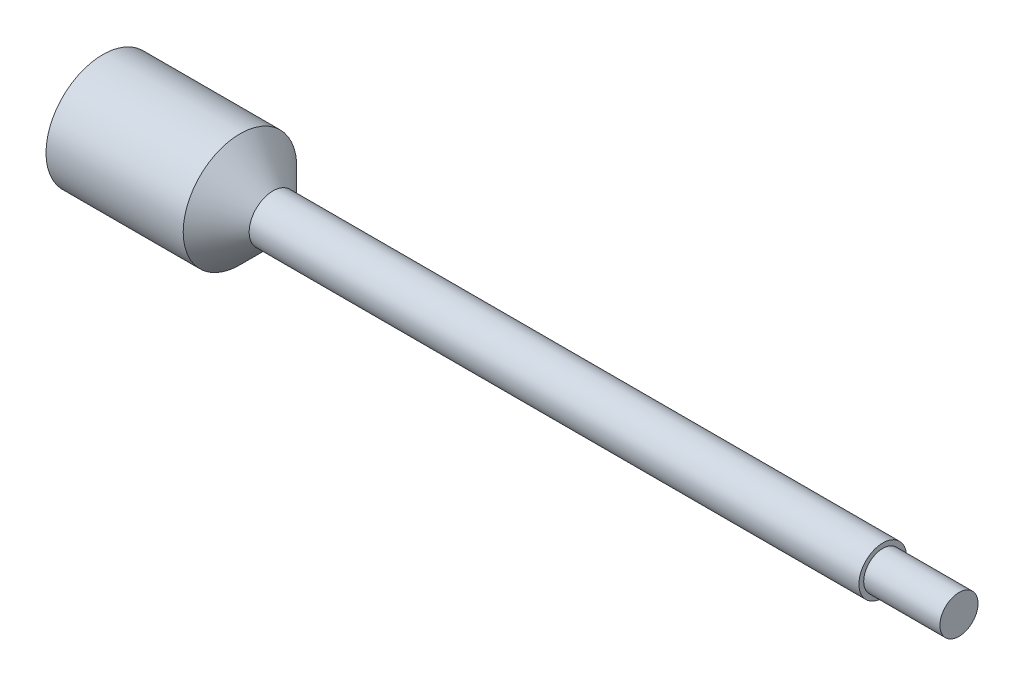
ISO-10303-21;
HEADER;
FILE_DESCRIPTION(('STEP AP214'),'2;1');
FILE_NAME('part.step','',(''),(''),'','','');
FILE_SCHEMA(('AUTOMOTIVE_DESIGN { 1 0 10303 214 1 1 1 1 }'));
ENDSEC;
DATA;
#1=APPLICATION_CONTEXT('core data for automotive mechanical design processes');
#2=APPLICATION_PROTOCOL_DEFINITION('international standard','automotive_design',2000,#1);
#3=PRODUCT_CONTEXT('',#1,'mechanical');
#4=PRODUCT('Part','Part','',(#3));
#5=PRODUCT_RELATED_PRODUCT_CATEGORY('part','',(#4));
#6=PRODUCT_DEFINITION_FORMATION('','',#4);
#7=PRODUCT_DEFINITION_CONTEXT('part definition',#1,'design');
#8=PRODUCT_DEFINITION('design','',#6,#7);
#9=PRODUCT_DEFINITION_SHAPE('','',#8);
#10=(LENGTH_UNIT() NAMED_UNIT(*) SI_UNIT(.MILLI.,.METRE.));
#11=(NAMED_UNIT(*) PLANE_ANGLE_UNIT() SI_UNIT($,.RADIAN.));
#12=(NAMED_UNIT(*) SI_UNIT($,.STERADIAN.) SOLID_ANGLE_UNIT());
#13=UNCERTAINTY_MEASURE_WITH_UNIT(LENGTH_MEASURE(1.E-05),#10,'distance_accuracy_value','');
#14=(GEOMETRIC_REPRESENTATION_CONTEXT(3) GLOBAL_UNCERTAINTY_ASSIGNED_CONTEXT((#13)) GLOBAL_UNIT_ASSIGNED_CONTEXT((#10,
#11,#12)) REPRESENTATION_CONTEXT('',''));
#15=CARTESIAN_POINT('',(0.,0.,0.));
#16=DIRECTION('',(0.,0.,1.));
#17=DIRECTION('',(1.,0.,0.));
#18=AXIS2_PLACEMENT_3D('',#15,#16,#17);
#19=CARTESIAN_POINT('',(-55.8411610675491,-112.071183448343,0.));
#20=DIRECTION('',(-1.,0.,0.));
#21=DIRECTION('',(0.,0.,1.));
#22=AXIS2_PLACEMENT_3D('',#19,#20,#21);
#23=PLANE('',#22);
#24=CARTESIAN_POINT('',(-55.8411610675491,0.,0.));
#25=DIRECTION('',(-1.,0.,0.));
#26=DIRECTION('',(0.,0.,1.));
#27=AXIS2_PLACEMENT_3D('',#24,#25,#26);
#28=CIRCLE('',#27,9.4615);
#29=CARTESIAN_POINT('',(-55.8411610675491,0.,9.4615));
#30=VERTEX_POINT('',#29);
#31=EDGE_CURVE('E54',#30,#30,#28,.T.);
#32=ORIENTED_EDGE('',*,*,#31,.T.);
#33=EDGE_LOOP('',(#32));
#34=FACE_BOUND('',#33,.T.);
#35=ADVANCED_FACE('F32',(#34),#23,.T.);
#36=CARTESIAN_POINT('',(86.8115889324509,-112.071183448343,0.));
#37=DIRECTION('',(1.,0.,0.));
#38=DIRECTION('',(0.,0.,-1.));
#39=AXIS2_PLACEMENT_3D('',#36,#37,#38);
#40=PLANE('',#39);
#41=CARTESIAN_POINT('',(86.8115889324509,0.,0.));
#42=DIRECTION('',(-1.,0.,0.));
#43=DIRECTION('',(0.,0.,1.));
#44=AXIS2_PLACEMENT_3D('',#41,#42,#43);
#45=CIRCLE('',#44,3.175);
#46=CARTESIAN_POINT('',(86.8115889324509,0.,3.175));
#47=VERTEX_POINT('',#46);
#48=EDGE_CURVE('E10',#47,#47,#45,.T.);
#49=ORIENTED_EDGE('',*,*,#48,.F.);
#50=EDGE_LOOP('',(#49));
#51=FACE_BOUND('',#50,.T.);
#52=ADVANCED_FACE('F71',(#51),#40,.T.);
#53=CARTESIAN_POINT('',(-55.8411610675491,0.,0.));
#54=DIRECTION('',(-1.,0.,0.));
#55=DIRECTION('',(0.,0.,1.));
#56=AXIS2_PLACEMENT_3D('',#53,#54,#55);
#57=CYLINDRICAL_SURFACE('',#56,3.175);
#58=ORIENTED_EDGE('',*,*,#48,.T.);
#59=EDGE_LOOP('',(#58));
#60=FACE_BOUND('',#59,.T.);
#61=CARTESIAN_POINT('',(74.1115889324509,0.,0.));
#62=DIRECTION('',(-1.,0.,0.));
#63=DIRECTION('',(0.,0.,1.));
#64=AXIS2_PLACEMENT_3D('',#61,#62,#63);
#65=CIRCLE('',#64,3.175);
#66=CARTESIAN_POINT('',(74.1115889324509,0.,3.175));
#67=VERTEX_POINT('',#66);
#68=EDGE_CURVE('E38',#67,#67,#65,.T.);
#69=ORIENTED_EDGE('',*,*,#68,.F.);
#70=EDGE_LOOP('',(#69));
#71=FACE_BOUND('',#70,.T.);
#72=ADVANCED_FACE('F75',(#60,#71),#57,.T.);
#73=CARTESIAN_POINT('',(74.1115889324509,-112.071183448343,0.));
#74=DIRECTION('',(1.,0.,0.));
#75=DIRECTION('',(0.,0.,-1.));
#76=AXIS2_PLACEMENT_3D('',#73,#74,#75);
#77=PLANE('',#76);
#78=ORIENTED_EDGE('',*,*,#68,.T.);
#79=EDGE_LOOP('',(#78));
#80=FACE_BOUND('',#79,.T.);
#81=CARTESIAN_POINT('',(74.1115889324509,0.,0.));
#82=DIRECTION('',(-1.,0.,0.));
#83=DIRECTION('',(0.,0.,1.));
#84=AXIS2_PLACEMENT_3D('',#81,#82,#83);
#85=CIRCLE('',#84,3.96874999999999);
#86=CARTESIAN_POINT('',(74.1115889324509,0.,3.96874999999999));
#87=VERTEX_POINT('',#86);
#88=EDGE_CURVE('E42',#87,#87,#85,.T.);
#89=ORIENTED_EDGE('',*,*,#88,.F.);
#90=EDGE_LOOP('',(#89));
#91=FACE_BOUND('',#90,.T.);
#92=ADVANCED_FACE('F80',(#80,#91),#77,.T.);
#93=CARTESIAN_POINT('',(-55.8411610675491,0.,0.));
#94=DIRECTION('',(-1.,0.,0.));
#95=DIRECTION('',(0.,0.,1.));
#96=AXIS2_PLACEMENT_3D('',#93,#94,#95);
#97=CYLINDRICAL_SURFACE('',#96,3.96875);
#98=ORIENTED_EDGE('',*,*,#88,.T.);
#99=EDGE_LOOP('',(#98));
#100=FACE_BOUND('',#99,.T.);
#101=CARTESIAN_POINT('',(-27.4884110675491,0.,0.));
#102=DIRECTION('',(-1.,0.,0.));
#103=DIRECTION('',(0.,0.,1.));
#104=AXIS2_PLACEMENT_3D('',#101,#102,#103);
#105=CIRCLE('',#104,3.96875000000001);
#106=CARTESIAN_POINT('',(-27.4884110675491,0.,3.96875000000001));
#107=VERTEX_POINT('',#106);
#108=EDGE_CURVE('E46',#107,#107,#105,.T.);
#109=ORIENTED_EDGE('',*,*,#108,.F.);
#110=EDGE_LOOP('',(#109));
#111=FACE_BOUND('',#110,.T.);
#112=ADVANCED_FACE('F67',(#100,#111),#97,.T.);
#113=CARTESIAN_POINT('',(-32.9811610675491,0.,0.));
#114=DIRECTION('',(-1.,0.,0.));
#115=DIRECTION('',(0.,0.,1.));
#116=AXIS2_PLACEMENT_3D('',#113,#114,#115);
#117=CONICAL_SURFACE('',#116,9.4615,0.785398163397451);
#118=ORIENTED_EDGE('',*,*,#108,.T.);
#119=EDGE_LOOP('',(#118));
#120=FACE_BOUND('',#119,.T.);
#121=CARTESIAN_POINT('',(-32.9811610675491,0.,0.));
#122=DIRECTION('',(-1.,0.,0.));
#123=DIRECTION('',(0.,0.,1.));
#124=AXIS2_PLACEMENT_3D('',#121,#122,#123);
#125=CIRCLE('',#124,9.4615);
#126=CARTESIAN_POINT('',(-32.9811610675491,0.,9.4615));
#127=VERTEX_POINT('',#126);
#128=EDGE_CURVE('E51',#127,#127,#125,.T.);
#129=ORIENTED_EDGE('',*,*,#128,.F.);
#130=EDGE_LOOP('',(#129));
#131=FACE_BOUND('',#130,.T.);
#132=ADVANCED_FACE('F61',(#120,#131),#117,.T.);
#133=CARTESIAN_POINT('',(-55.8411610675491,0.,0.));
#134=DIRECTION('',(-1.,0.,0.));
#135=DIRECTION('',(0.,0.,1.));
#136=AXIS2_PLACEMENT_3D('',#133,#134,#135);
#137=CYLINDRICAL_SURFACE('',#136,9.4615);
#138=ORIENTED_EDGE('',*,*,#128,.T.);
#139=EDGE_LOOP('',(#138));
#140=FACE_BOUND('',#139,.T.);
#141=ORIENTED_EDGE('',*,*,#31,.F.);
#142=EDGE_LOOP('',(#141));
#143=FACE_BOUND('',#142,.T.);
#144=ADVANCED_FACE('F59',(#140,#143),#137,.T.);
#145=CLOSED_SHELL('',(#35,#52,#72,#92,#112,#132,#144));
#146=MANIFOLD_SOLID_BREP('B2',#145);
#147=ADVANCED_BREP_SHAPE_REPRESENTATION('',(#18,#146),#14);
#148=SHAPE_DEFINITION_REPRESENTATION(#9,#147);
ENDSEC;
END-ISO-10303-21;
